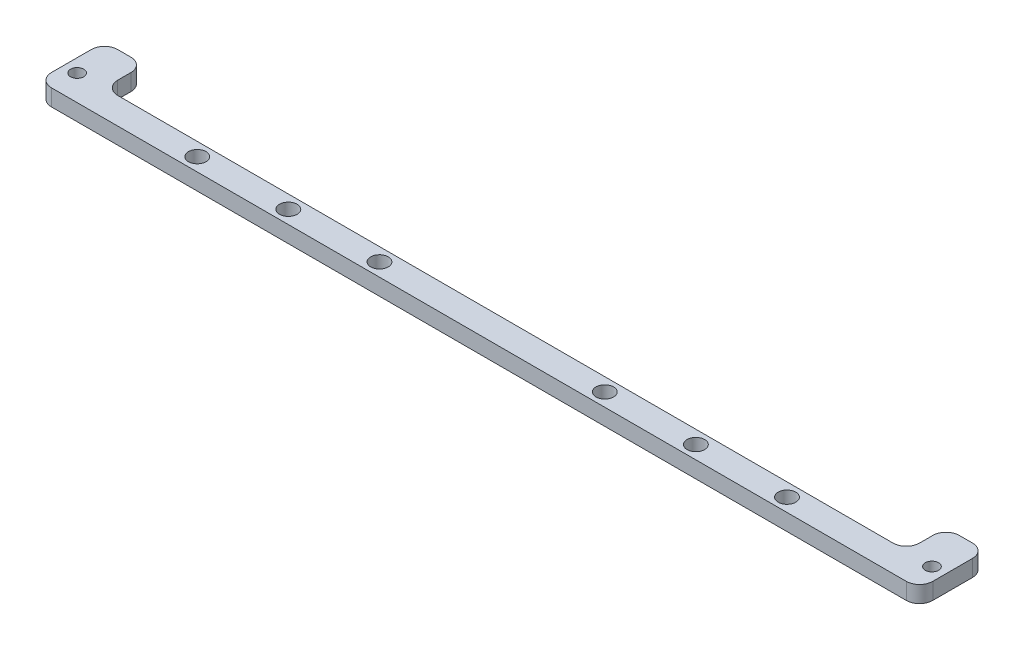
ISO-10303-21;
HEADER;
FILE_DESCRIPTION(('STEP AP214'),'2;1');
FILE_NAME('part.step','',(''),(''),'','','');
FILE_SCHEMA(('AUTOMOTIVE_DESIGN { 1 0 10303 214 1 1 1 1 }'));
ENDSEC;
DATA;
#1=APPLICATION_CONTEXT('core data for automotive mechanical design processes');
#2=APPLICATION_PROTOCOL_DEFINITION('international standard','automotive_design',2000,#1);
#3=PRODUCT_CONTEXT('',#1,'mechanical');
#4=PRODUCT('Part','Part','',(#3));
#5=PRODUCT_RELATED_PRODUCT_CATEGORY('part','',(#4));
#6=PRODUCT_DEFINITION_FORMATION('','',#4);
#7=PRODUCT_DEFINITION_CONTEXT('part definition',#1,'design');
#8=PRODUCT_DEFINITION('design','',#6,#7);
#9=PRODUCT_DEFINITION_SHAPE('','',#8);
#10=(LENGTH_UNIT() NAMED_UNIT(*) SI_UNIT(.MILLI.,.METRE.));
#11=(NAMED_UNIT(*) PLANE_ANGLE_UNIT() SI_UNIT($,.RADIAN.));
#12=(NAMED_UNIT(*) SI_UNIT($,.STERADIAN.) SOLID_ANGLE_UNIT());
#13=UNCERTAINTY_MEASURE_WITH_UNIT(LENGTH_MEASURE(1.E-05),#10,'distance_accuracy_value','');
#14=(GEOMETRIC_REPRESENTATION_CONTEXT(3) GLOBAL_UNCERTAINTY_ASSIGNED_CONTEXT((#13)) GLOBAL_UNIT_ASSIGNED_CONTEXT((#10,
#11,#12)) REPRESENTATION_CONTEXT('',''));
#15=CARTESIAN_POINT('',(0.,0.,0.));
#16=DIRECTION('',(0.,0.,1.));
#17=DIRECTION('',(1.,0.,0.));
#18=AXIS2_PLACEMENT_3D('',#15,#16,#17);
#19=CARTESIAN_POINT('',(-133.,5.,0.));
#20=DIRECTION('',(-1.,0.,0.));
#21=DIRECTION('',(0.,0.,1.));
#22=AXIS2_PLACEMENT_3D('',#19,#20,#21);
#23=PLANE('',#22);
#24=DIRECTION('',(0.,0.,-1.));
#25=VECTOR('',#24,1.);
#26=CARTESIAN_POINT('',(-133.,5.,0.));
#27=LINE('',#26,#25);
#28=CARTESIAN_POINT('',(-133.,5.,0.));
#29=VERTEX_POINT('',#28);
#30=CARTESIAN_POINT('',(-133.,5.,-12.));
#31=VERTEX_POINT('',#30);
#32=EDGE_CURVE('E335',#29,#31,#27,.T.);
#33=ORIENTED_EDGE('',*,*,#32,.T.);
#34=DIRECTION('',(0.,-1.,0.));
#35=VECTOR('',#34,1.);
#36=CARTESIAN_POINT('',(-133.,5.,-12.));
#37=LINE('',#36,#35);
#38=CARTESIAN_POINT('',(-133.,0.,-12.));
#39=VERTEX_POINT('',#38);
#40=EDGE_CURVE('E172',#31,#39,#37,.T.);
#41=ORIENTED_EDGE('',*,*,#40,.T.);
#42=DIRECTION('',(0.,0.,-1.));
#43=VECTOR('',#42,1.);
#44=CARTESIAN_POINT('',(-133.,0.,0.));
#45=LINE('',#44,#43);
#46=CARTESIAN_POINT('',(-133.,0.,0.));
#47=VERTEX_POINT('',#46);
#48=EDGE_CURVE('E156',#47,#39,#45,.T.);
#49=ORIENTED_EDGE('',*,*,#48,.F.);
#50=DIRECTION('',(0.,-1.,0.));
#51=VECTOR('',#50,1.);
#52=CARTESIAN_POINT('',(-133.,5.,0.));
#53=LINE('',#52,#51);
#54=EDGE_CURVE('E169',#47,#29,#53,.F.);
#55=ORIENTED_EDGE('',*,*,#54,.T.);
#56=EDGE_LOOP('',(#33,#41,#49,#55));
#57=FACE_BOUND('',#56,.T.);
#58=ADVANCED_FACE('F38',(#57),#23,.T.);
#59=CARTESIAN_POINT('',(0.,5.,4.));
#60=DIRECTION('',(0.,0.,-1.));
#61=DIRECTION('',(-1.,0.,0.));
#62=AXIS2_PLACEMENT_3D('',#59,#60,#61);
#63=PLANE('',#62);
#64=DIRECTION('',(1.,0.,0.));
#65=VECTOR('',#64,1.);
#66=CARTESIAN_POINT('',(0.,5.,4.));
#67=LINE('',#66,#65);
#68=CARTESIAN_POINT('',(-129.,5.,4.));
#69=VERTEX_POINT('',#68);
#70=CARTESIAN_POINT('',(129.,5.,4.));
#71=VERTEX_POINT('',#70);
#72=EDGE_CURVE('E339',#69,#71,#67,.T.);
#73=ORIENTED_EDGE('',*,*,#72,.F.);
#74=DIRECTION('',(0.,-1.,0.));
#75=VECTOR('',#74,1.);
#76=CARTESIAN_POINT('',(-129.,0.,4.));
#77=LINE('',#76,#75);
#78=CARTESIAN_POINT('',(-129.,0.,4.));
#79=VERTEX_POINT('',#78);
#80=EDGE_CURVE('E238',#69,#79,#77,.T.);
#81=ORIENTED_EDGE('',*,*,#80,.T.);
#82=DIRECTION('',(1.,0.,0.));
#83=VECTOR('',#82,1.);
#84=CARTESIAN_POINT('',(0.,0.,4.));
#85=LINE('',#84,#83);
#86=CARTESIAN_POINT('',(129.,0.,4.));
#87=VERTEX_POINT('',#86);
#88=EDGE_CURVE('E158',#79,#87,#85,.T.);
#89=ORIENTED_EDGE('',*,*,#88,.T.);
#90=DIRECTION('',(0.,-1.,0.));
#91=VECTOR('',#90,1.);
#92=CARTESIAN_POINT('',(129.,5.,4.));
#93=LINE('',#92,#91);
#94=EDGE_CURVE('E236',#87,#71,#93,.F.);
#95=ORIENTED_EDGE('',*,*,#94,.T.);
#96=EDGE_LOOP('',(#73,#81,#89,#95));
#97=FACE_BOUND('',#96,.T.);
#98=ADVANCED_FACE('F368',(#97),#63,.F.);
#99=CARTESIAN_POINT('',(133.,5.,0.));
#100=DIRECTION('',(-1.,0.,0.));
#101=DIRECTION('',(0.,0.,1.));
#102=AXIS2_PLACEMENT_3D('',#99,#100,#101);
#103=PLANE('',#102);
#104=DIRECTION('',(0.,0.,-1.));
#105=VECTOR('',#104,1.);
#106=CARTESIAN_POINT('',(133.,0.,0.));
#107=LINE('',#106,#105);
#108=CARTESIAN_POINT('',(133.,0.,0.));
#109=VERTEX_POINT('',#108);
#110=CARTESIAN_POINT('',(133.,0.,-12.));
#111=VERTEX_POINT('',#110);
#112=EDGE_CURVE('E299',#109,#111,#107,.T.);
#113=ORIENTED_EDGE('',*,*,#112,.T.);
#114=DIRECTION('',(0.,-1.,0.));
#115=VECTOR('',#114,1.);
#116=CARTESIAN_POINT('',(133.,5.,-12.));
#117=LINE('',#116,#115);
#118=CARTESIAN_POINT('',(133.,5.,-12.));
#119=VERTEX_POINT('',#118);
#120=EDGE_CURVE('E234',#111,#119,#117,.F.);
#121=ORIENTED_EDGE('',*,*,#120,.T.);
#122=DIRECTION('',(0.,0.,-1.));
#123=VECTOR('',#122,1.);
#124=CARTESIAN_POINT('',(133.,5.,0.));
#125=LINE('',#124,#123);
#126=CARTESIAN_POINT('',(133.,5.,0.));
#127=VERTEX_POINT('',#126);
#128=EDGE_CURVE('E342',#127,#119,#125,.T.);
#129=ORIENTED_EDGE('',*,*,#128,.F.);
#130=DIRECTION('',(0.,-1.,0.));
#131=VECTOR('',#130,1.);
#132=CARTESIAN_POINT('',(133.,5.,0.));
#133=LINE('',#132,#131);
#134=EDGE_CURVE('E231',#127,#109,#133,.T.);
#135=ORIENTED_EDGE('',*,*,#134,.T.);
#136=EDGE_LOOP('',(#113,#121,#129,#135));
#137=FACE_BOUND('',#136,.T.);
#138=ADVANCED_FACE('F360',(#137),#103,.F.);
#139=CARTESIAN_POINT('',(0.,5.,-16.));
#140=DIRECTION('',(0.,0.,1.));
#141=DIRECTION('',(1.,0.,0.));
#142=AXIS2_PLACEMENT_3D('',#139,#140,#141);
#143=PLANE('',#142);
#144=DIRECTION('',(-1.,0.,0.));
#145=VECTOR('',#144,1.);
#146=CARTESIAN_POINT('',(0.,0.,-16.));
#147=LINE('',#146,#145);
#148=CARTESIAN_POINT('',(129.,0.,-16.));
#149=VERTEX_POINT('',#148);
#150=CARTESIAN_POINT('',(125.,0.,-16.));
#151=VERTEX_POINT('',#150);
#152=EDGE_CURVE('E256',#149,#151,#147,.T.);
#153=ORIENTED_EDGE('',*,*,#152,.T.);
#154=DIRECTION('',(0.,-1.,0.));
#155=VECTOR('',#154,1.);
#156=CARTESIAN_POINT('',(125.,5.,-16.));
#157=LINE('',#156,#155);
#158=CARTESIAN_POINT('',(125.,5.,-16.));
#159=VERTEX_POINT('',#158);
#160=EDGE_CURVE('E229',#151,#159,#157,.F.);
#161=ORIENTED_EDGE('',*,*,#160,.T.);
#162=DIRECTION('',(-1.,0.,0.));
#163=VECTOR('',#162,1.);
#164=CARTESIAN_POINT('',(0.,5.,-16.));
#165=LINE('',#164,#163);
#166=CARTESIAN_POINT('',(129.,5.,-16.));
#167=VERTEX_POINT('',#166);
#168=EDGE_CURVE('E273',#167,#159,#165,.T.);
#169=ORIENTED_EDGE('',*,*,#168,.F.);
#170=DIRECTION('',(0.,-1.,0.));
#171=VECTOR('',#170,1.);
#172=CARTESIAN_POINT('',(129.,5.,-16.));
#173=LINE('',#172,#171);
#174=EDGE_CURVE('E226',#167,#149,#173,.T.);
#175=ORIENTED_EDGE('',*,*,#174,.T.);
#176=EDGE_LOOP('',(#153,#161,#169,#175));
#177=FACE_BOUND('',#176,.T.);
#178=ADVANCED_FACE('F354',(#177),#143,.F.);
#179=CARTESIAN_POINT('',(121.,5.,0.));
#180=DIRECTION('',(-1.,0.,0.));
#181=DIRECTION('',(0.,0.,1.));
#182=AXIS2_PLACEMENT_3D('',#179,#180,#181);
#183=PLANE('',#182);
#184=DIRECTION('',(0.,0.,-1.));
#185=VECTOR('',#184,1.);
#186=CARTESIAN_POINT('',(121.,0.,0.));
#187=LINE('',#186,#185);
#188=CARTESIAN_POINT('',(121.,0.,-8.));
#189=VERTEX_POINT('',#188);
#190=CARTESIAN_POINT('',(121.,0.,-12.));
#191=VERTEX_POINT('',#190);
#192=EDGE_CURVE('E245',#189,#191,#187,.T.);
#193=ORIENTED_EDGE('',*,*,#192,.F.);
#194=DIRECTION('',(0.,-1.,0.));
#195=VECTOR('',#194,1.);
#196=CARTESIAN_POINT('',(121.,5.,-8.));
#197=LINE('',#196,#195);
#198=CARTESIAN_POINT('',(121.,5.,-8.));
#199=VERTEX_POINT('',#198);
#200=EDGE_CURVE('E224',#189,#199,#197,.F.);
#201=ORIENTED_EDGE('',*,*,#200,.T.);
#202=DIRECTION('',(0.,0.,-1.));
#203=VECTOR('',#202,1.);
#204=CARTESIAN_POINT('',(121.,5.,0.));
#205=LINE('',#204,#203);
#206=CARTESIAN_POINT('',(121.,5.,-12.));
#207=VERTEX_POINT('',#206);
#208=EDGE_CURVE('E265',#199,#207,#205,.T.);
#209=ORIENTED_EDGE('',*,*,#208,.T.);
#210=DIRECTION('',(0.,-1.,0.));
#211=VECTOR('',#210,1.);
#212=CARTESIAN_POINT('',(121.,0.,-12.));
#213=LINE('',#212,#211);
#214=EDGE_CURVE('E221',#207,#191,#213,.T.);
#215=ORIENTED_EDGE('',*,*,#214,.T.);
#216=EDGE_LOOP('',(#193,#201,#209,#215));
#217=FACE_BOUND('',#216,.T.);
#218=ADVANCED_FACE('F252',(#217),#183,.T.);
#219=CARTESIAN_POINT('',(0.,5.,-4.));
#220=DIRECTION('',(0.,0.,-1.));
#221=DIRECTION('',(-1.,0.,0.));
#222=AXIS2_PLACEMENT_3D('',#219,#220,#221);
#223=PLANE('',#222);
#224=DIRECTION('',(1.,0.,0.));
#225=VECTOR('',#224,1.);
#226=CARTESIAN_POINT('',(0.,0.,-4.));
#227=LINE('',#226,#225);
#228=CARTESIAN_POINT('',(-117.,0.,-4.));
#229=VERTEX_POINT('',#228);
#230=CARTESIAN_POINT('',(117.,0.,-4.));
#231=VERTEX_POINT('',#230);
#232=EDGE_CURVE('E247',#229,#231,#227,.T.);
#233=ORIENTED_EDGE('',*,*,#232,.F.);
#234=DIRECTION('',(0.,-1.,0.));
#235=VECTOR('',#234,1.);
#236=CARTESIAN_POINT('',(-117.,5.,-4.));
#237=LINE('',#236,#235);
#238=CARTESIAN_POINT('',(-117.,5.,-4.));
#239=VERTEX_POINT('',#238);
#240=EDGE_CURVE('E219',#229,#239,#237,.F.);
#241=ORIENTED_EDGE('',*,*,#240,.T.);
#242=DIRECTION('',(1.,0.,0.));
#243=VECTOR('',#242,1.);
#244=CARTESIAN_POINT('',(0.,5.,-4.));
#245=LINE('',#244,#243);
#246=CARTESIAN_POINT('',(117.,5.,-4.));
#247=VERTEX_POINT('',#246);
#248=EDGE_CURVE('E264',#239,#247,#245,.T.);
#249=ORIENTED_EDGE('',*,*,#248,.T.);
#250=DIRECTION('',(0.,-1.,0.));
#251=VECTOR('',#250,1.);
#252=CARTESIAN_POINT('',(117.,0.,-4.));
#253=LINE('',#252,#251);
#254=EDGE_CURVE('E216',#247,#231,#253,.T.);
#255=ORIENTED_EDGE('',*,*,#254,.T.);
#256=EDGE_LOOP('',(#233,#241,#249,#255));
#257=FACE_BOUND('',#256,.T.);
#258=ADVANCED_FACE('F267',(#257),#223,.T.);
#259=CARTESIAN_POINT('',(-121.,5.,0.));
#260=DIRECTION('',(-1.,0.,0.));
#261=DIRECTION('',(0.,0.,1.));
#262=AXIS2_PLACEMENT_3D('',#259,#260,#261);
#263=PLANE('',#262);
#264=DIRECTION('',(0.,0.,-1.));
#265=VECTOR('',#264,1.);
#266=CARTESIAN_POINT('',(-121.,0.,0.));
#267=LINE('',#266,#265);
#268=CARTESIAN_POINT('',(-121.,0.,-8.));
#269=VERTEX_POINT('',#268);
#270=CARTESIAN_POINT('',(-121.,0.,-12.));
#271=VERTEX_POINT('',#270);
#272=EDGE_CURVE('E305',#269,#271,#267,.T.);
#273=ORIENTED_EDGE('',*,*,#272,.T.);
#274=DIRECTION('',(0.,-1.,0.));
#275=VECTOR('',#274,1.);
#276=CARTESIAN_POINT('',(-121.,5.,-12.));
#277=LINE('',#276,#275);
#278=CARTESIAN_POINT('',(-121.,5.,-12.));
#279=VERTEX_POINT('',#278);
#280=EDGE_CURVE('E53',#271,#279,#277,.F.);
#281=ORIENTED_EDGE('',*,*,#280,.T.);
#282=DIRECTION('',(0.,0.,-1.));
#283=VECTOR('',#282,1.);
#284=CARTESIAN_POINT('',(-121.,5.,0.));
#285=LINE('',#284,#283);
#286=CARTESIAN_POINT('',(-121.,5.,-8.));
#287=VERTEX_POINT('',#286);
#288=EDGE_CURVE('E269',#287,#279,#285,.T.);
#289=ORIENTED_EDGE('',*,*,#288,.F.);
#290=DIRECTION('',(0.,-1.,0.));
#291=VECTOR('',#290,1.);
#292=CARTESIAN_POINT('',(-121.,5.,-8.));
#293=LINE('',#292,#291);
#294=EDGE_CURVE('E212',#287,#269,#293,.T.);
#295=ORIENTED_EDGE('',*,*,#294,.T.);
#296=EDGE_LOOP('',(#273,#281,#289,#295));
#297=FACE_BOUND('',#296,.T.);
#298=ADVANCED_FACE('F381',(#297),#263,.F.);
#299=CARTESIAN_POINT('',(-61.5,5.,0.));
#300=DIRECTION('',(0.,-1.,0.));
#301=DIRECTION('',(0.,0.,-1.));
#302=AXIS2_PLACEMENT_3D('',#299,#300,#301);
#303=CYLINDRICAL_SURFACE('',#302,2.65);
#304=CARTESIAN_POINT('',(-61.5,5.,0.));
#305=DIRECTION('',(0.,1.,0.));
#306=DIRECTION('',(0.,0.,1.));
#307=AXIS2_PLACEMENT_3D('',#304,#305,#306);
#308=CIRCLE('',#307,2.65);
#309=CARTESIAN_POINT('',(-61.5,5.,2.65));
#310=VERTEX_POINT('',#309);
#311=EDGE_CURVE('E182',#310,#310,#308,.T.);
#312=ORIENTED_EDGE('',*,*,#311,.T.);
#313=EDGE_LOOP('',(#312));
#314=FACE_BOUND('',#313,.T.);
#315=CARTESIAN_POINT('',(-61.5,0.,0.));
#316=DIRECTION('',(0.,1.,0.));
#317=DIRECTION('',(0.,0.,1.));
#318=AXIS2_PLACEMENT_3D('',#315,#316,#317);
#319=CIRCLE('',#318,2.65);
#320=CARTESIAN_POINT('',(-61.5,0.,2.65));
#321=VERTEX_POINT('',#320);
#322=EDGE_CURVE('E321',#321,#321,#319,.T.);
#323=ORIENTED_EDGE('',*,*,#322,.F.);
#324=EDGE_LOOP('',(#323));
#325=FACE_BOUND('',#324,.T.);
#326=ADVANCED_FACE('F425',(#314,#325),#303,.F.);
#327=CARTESIAN_POINT('',(-34.,5.,0.));
#328=DIRECTION('',(0.,-1.,0.));
#329=DIRECTION('',(0.,0.,-1.));
#330=AXIS2_PLACEMENT_3D('',#327,#328,#329);
#331=CYLINDRICAL_SURFACE('',#330,2.65);
#332=CARTESIAN_POINT('',(-34.,5.,0.));
#333=DIRECTION('',(0.,1.,0.));
#334=DIRECTION('',(0.,0.,1.));
#335=AXIS2_PLACEMENT_3D('',#332,#333,#334);
#336=CIRCLE('',#335,2.65);
#337=CARTESIAN_POINT('',(-34.,5.,2.65));
#338=VERTEX_POINT('',#337);
#339=EDGE_CURVE('E288',#338,#338,#336,.T.);
#340=ORIENTED_EDGE('',*,*,#339,.T.);
#341=EDGE_LOOP('',(#340));
#342=FACE_BOUND('',#341,.T.);
#343=CARTESIAN_POINT('',(-34.,0.,0.));
#344=DIRECTION('',(0.,1.,0.));
#345=DIRECTION('',(0.,0.,1.));
#346=AXIS2_PLACEMENT_3D('',#343,#344,#345);
#347=CIRCLE('',#346,2.65);
#348=CARTESIAN_POINT('',(-34.,0.,2.65));
#349=VERTEX_POINT('',#348);
#350=EDGE_CURVE('E319',#349,#349,#347,.T.);
#351=ORIENTED_EDGE('',*,*,#350,.F.);
#352=EDGE_LOOP('',(#351));
#353=FACE_BOUND('',#352,.T.);
#354=ADVANCED_FACE('F428',(#342,#353),#331,.F.);
#355=CARTESIAN_POINT('',(34.,5.,0.));
#356=DIRECTION('',(0.,-1.,0.));
#357=DIRECTION('',(0.,0.,-1.));
#358=AXIS2_PLACEMENT_3D('',#355,#356,#357);
#359=CYLINDRICAL_SURFACE('',#358,2.65);
#360=CARTESIAN_POINT('',(34.,5.,0.));
#361=DIRECTION('',(0.,1.,0.));
#362=DIRECTION('',(0.,0.,1.));
#363=AXIS2_PLACEMENT_3D('',#360,#361,#362);
#364=CIRCLE('',#363,2.65);
#365=CARTESIAN_POINT('',(34.,5.,2.64999999999999));
#366=VERTEX_POINT('',#365);
#367=EDGE_CURVE('E285',#366,#366,#364,.T.);
#368=ORIENTED_EDGE('',*,*,#367,.T.);
#369=EDGE_LOOP('',(#368));
#370=FACE_BOUND('',#369,.T.);
#371=CARTESIAN_POINT('',(34.,0.,0.));
#372=DIRECTION('',(0.,1.,0.));
#373=DIRECTION('',(0.,0.,1.));
#374=AXIS2_PLACEMENT_3D('',#371,#372,#373);
#375=CIRCLE('',#374,2.65);
#376=CARTESIAN_POINT('',(34.,0.,2.64999999999999));
#377=VERTEX_POINT('',#376);
#378=EDGE_CURVE('E316',#377,#377,#375,.T.);
#379=ORIENTED_EDGE('',*,*,#378,.F.);
#380=EDGE_LOOP('',(#379));
#381=FACE_BOUND('',#380,.T.);
#382=ADVANCED_FACE('F432',(#370,#381),#359,.F.);
#383=CARTESIAN_POINT('',(89.,5.,0.));
#384=DIRECTION('',(0.,-1.,0.));
#385=DIRECTION('',(0.,0.,-1.));
#386=AXIS2_PLACEMENT_3D('',#383,#384,#385);
#387=CYLINDRICAL_SURFACE('',#386,2.65);
#388=CARTESIAN_POINT('',(89.,5.,0.));
#389=DIRECTION('',(0.,1.,0.));
#390=DIRECTION('',(0.,0.,1.));
#391=AXIS2_PLACEMENT_3D('',#388,#389,#390);
#392=CIRCLE('',#391,2.65);
#393=CARTESIAN_POINT('',(89.,5.,2.64999999999997));
#394=VERTEX_POINT('',#393);
#395=EDGE_CURVE('E282',#394,#394,#392,.T.);
#396=ORIENTED_EDGE('',*,*,#395,.T.);
#397=EDGE_LOOP('',(#396));
#398=FACE_BOUND('',#397,.T.);
#399=CARTESIAN_POINT('',(89.,0.,0.));
#400=DIRECTION('',(0.,1.,0.));
#401=DIRECTION('',(0.,0.,1.));
#402=AXIS2_PLACEMENT_3D('',#399,#400,#401);
#403=CIRCLE('',#402,2.65);
#404=CARTESIAN_POINT('',(89.,0.,2.64999999999997));
#405=VERTEX_POINT('',#404);
#406=EDGE_CURVE('E313',#405,#405,#403,.T.);
#407=ORIENTED_EDGE('',*,*,#406,.F.);
#408=EDGE_LOOP('',(#407));
#409=FACE_BOUND('',#408,.T.);
#410=ADVANCED_FACE('F436',(#398,#409),#387,.F.);
#411=CARTESIAN_POINT('',(61.5,5.,0.));
#412=DIRECTION('',(0.,-1.,0.));
#413=DIRECTION('',(0.,0.,-1.));
#414=AXIS2_PLACEMENT_3D('',#411,#412,#413);
#415=CYLINDRICAL_SURFACE('',#414,2.65);
#416=CARTESIAN_POINT('',(61.5,5.,0.));
#417=DIRECTION('',(0.,1.,0.));
#418=DIRECTION('',(0.,0.,1.));
#419=AXIS2_PLACEMENT_3D('',#416,#417,#418);
#420=CIRCLE('',#419,2.65);
#421=CARTESIAN_POINT('',(61.5,5.,2.64999999999998));
#422=VERTEX_POINT('',#421);
#423=EDGE_CURVE('E279',#422,#422,#420,.T.);
#424=ORIENTED_EDGE('',*,*,#423,.T.);
#425=EDGE_LOOP('',(#424));
#426=FACE_BOUND('',#425,.T.);
#427=CARTESIAN_POINT('',(61.5,0.,0.));
#428=DIRECTION('',(0.,1.,0.));
#429=DIRECTION('',(0.,0.,1.));
#430=AXIS2_PLACEMENT_3D('',#427,#428,#429);
#431=CIRCLE('',#430,2.65);
#432=CARTESIAN_POINT('',(61.5,0.,2.64999999999998));
#433=VERTEX_POINT('',#432);
#434=EDGE_CURVE('E310',#433,#433,#431,.T.);
#435=ORIENTED_EDGE('',*,*,#434,.F.);
#436=EDGE_LOOP('',(#435));
#437=FACE_BOUND('',#436,.T.);
#438=ADVANCED_FACE('F440',(#426,#437),#415,.F.);
#439=CARTESIAN_POINT('',(0.,5.,-16.));
#440=DIRECTION('',(0.,0.,-1.));
#441=DIRECTION('',(-1.,0.,0.));
#442=AXIS2_PLACEMENT_3D('',#439,#440,#441);
#443=PLANE('',#442);
#444=DIRECTION('',(1.,0.,0.));
#445=VECTOR('',#444,1.);
#446=CARTESIAN_POINT('',(0.,0.,-16.));
#447=LINE('',#446,#445);
#448=CARTESIAN_POINT('',(-129.,0.,-16.));
#449=VERTEX_POINT('',#448);
#450=CARTESIAN_POINT('',(-125.,0.,-16.));
#451=VERTEX_POINT('',#450);
#452=EDGE_CURVE('E307',#449,#451,#447,.T.);
#453=ORIENTED_EDGE('',*,*,#452,.F.);
#454=DIRECTION('',(0.,-1.,0.));
#455=VECTOR('',#454,1.);
#456=CARTESIAN_POINT('',(-129.,5.,-16.));
#457=LINE('',#456,#455);
#458=CARTESIAN_POINT('',(-129.,5.,-16.));
#459=VERTEX_POINT('',#458);
#460=EDGE_CURVE('E199',#449,#459,#457,.F.);
#461=ORIENTED_EDGE('',*,*,#460,.T.);
#462=DIRECTION('',(1.,0.,0.));
#463=VECTOR('',#462,1.);
#464=CARTESIAN_POINT('',(0.,5.,-16.));
#465=LINE('',#464,#463);
#466=CARTESIAN_POINT('',(-125.,5.,-16.));
#467=VERTEX_POINT('',#466);
#468=EDGE_CURVE('E271',#459,#467,#465,.T.);
#469=ORIENTED_EDGE('',*,*,#468,.T.);
#470=DIRECTION('',(0.,-1.,0.));
#471=VECTOR('',#470,1.);
#472=CARTESIAN_POINT('',(-125.,0.,-16.));
#473=LINE('',#472,#471);
#474=EDGE_CURVE('E196',#467,#451,#473,.T.);
#475=ORIENTED_EDGE('',*,*,#474,.T.);
#476=EDGE_LOOP('',(#453,#461,#469,#475));
#477=FACE_BOUND('',#476,.T.);
#478=ADVANCED_FACE('F375',(#477),#443,.T.);
#479=CARTESIAN_POINT('',(-129.,5.,-3.75));
#480=DIRECTION('',(0.,-1.,0.));
#481=DIRECTION('',(0.,0.,-1.));
#482=AXIS2_PLACEMENT_3D('',#479,#480,#481);
#483=CYLINDRICAL_SURFACE('',#482,2.);
#484=CARTESIAN_POINT('',(-129.,5.,-3.75));
#485=DIRECTION('',(0.,1.,0.));
#486=DIRECTION('',(0.,0.,1.));
#487=AXIS2_PLACEMENT_3D('',#484,#485,#486);
#488=CIRCLE('',#487,2.);
#489=CARTESIAN_POINT('',(-129.,5.,-1.75));
#490=VERTEX_POINT('',#489);
#491=EDGE_CURVE('E330',#490,#490,#488,.F.);
#492=ORIENTED_EDGE('',*,*,#491,.F.);
#493=EDGE_LOOP('',(#492));
#494=FACE_BOUND('',#493,.T.);
#495=CARTESIAN_POINT('',(-129.,0.,-3.75));
#496=DIRECTION('',(0.,1.,0.));
#497=DIRECTION('',(0.,0.,1.));
#498=AXIS2_PLACEMENT_3D('',#495,#496,#497);
#499=CIRCLE('',#498,2.);
#500=CARTESIAN_POINT('',(-129.,0.,-1.75));
#501=VERTEX_POINT('',#500);
#502=EDGE_CURVE('E173',#501,#501,#499,.F.);
#503=ORIENTED_EDGE('',*,*,#502,.T.);
#504=EDGE_LOOP('',(#503));
#505=FACE_BOUND('',#504,.T.);
#506=ADVANCED_FACE('F401',(#494,#505),#483,.F.);
#507=CARTESIAN_POINT('',(129.,5.,-3.75));
#508=DIRECTION('',(0.,-1.,0.));
#509=DIRECTION('',(0.,0.,-1.));
#510=AXIS2_PLACEMENT_3D('',#507,#508,#509);
#511=CYLINDRICAL_SURFACE('',#510,2.);
#512=CARTESIAN_POINT('',(129.,5.,-3.75));
#513=DIRECTION('',(0.,1.,0.));
#514=DIRECTION('',(0.,0.,1.));
#515=AXIS2_PLACEMENT_3D('',#512,#513,#514);
#516=CIRCLE('',#515,2.);
#517=CARTESIAN_POINT('',(129.,5.,-1.75));
#518=VERTEX_POINT('',#517);
#519=EDGE_CURVE('E326',#518,#518,#516,.T.);
#520=ORIENTED_EDGE('',*,*,#519,.T.);
#521=EDGE_LOOP('',(#520));
#522=FACE_BOUND('',#521,.T.);
#523=CARTESIAN_POINT('',(129.,0.,-3.75));
#524=DIRECTION('',(0.,1.,0.));
#525=DIRECTION('',(0.,0.,1.));
#526=AXIS2_PLACEMENT_3D('',#523,#524,#525);
#527=CIRCLE('',#526,2.);
#528=CARTESIAN_POINT('',(129.,0.,-1.75));
#529=VERTEX_POINT('',#528);
#530=EDGE_CURVE('E293',#529,#529,#527,.T.);
#531=ORIENTED_EDGE('',*,*,#530,.F.);
#532=EDGE_LOOP('',(#531));
#533=FACE_BOUND('',#532,.T.);
#534=ADVANCED_FACE('F404',(#522,#533),#511,.F.);
#535=CARTESIAN_POINT('',(-89.,5.,0.));
#536=DIRECTION('',(0.,-1.,0.));
#537=DIRECTION('',(0.,0.,-1.));
#538=AXIS2_PLACEMENT_3D('',#535,#536,#537);
#539=CYLINDRICAL_SURFACE('',#538,2.65);
#540=CARTESIAN_POINT('',(-89.,5.,0.));
#541=DIRECTION('',(0.,1.,0.));
#542=DIRECTION('',(0.,0.,1.));
#543=AXIS2_PLACEMENT_3D('',#540,#541,#542);
#544=CIRCLE('',#543,2.65);
#545=CARTESIAN_POINT('',(-89.,5.,2.65));
#546=VERTEX_POINT('',#545);
#547=EDGE_CURVE('E178',#546,#546,#544,.T.);
#548=ORIENTED_EDGE('',*,*,#547,.T.);
#549=EDGE_LOOP('',(#548));
#550=FACE_BOUND('',#549,.T.);
#551=CARTESIAN_POINT('',(-89.,0.,0.));
#552=DIRECTION('',(0.,1.,0.));
#553=DIRECTION('',(0.,0.,1.));
#554=AXIS2_PLACEMENT_3D('',#551,#552,#553);
#555=CIRCLE('',#554,2.65);
#556=CARTESIAN_POINT('',(-89.,0.,2.65));
#557=VERTEX_POINT('',#556);
#558=EDGE_CURVE('E185',#557,#557,#555,.T.);
#559=ORIENTED_EDGE('',*,*,#558,.F.);
#560=EDGE_LOOP('',(#559));
#561=FACE_BOUND('',#560,.T.);
#562=ADVANCED_FACE('F408',(#550,#561),#539,.F.);
#563=CARTESIAN_POINT('',(0.,5.,0.));
#564=DIRECTION('',(0.,1.,0.));
#565=DIRECTION('',(0.,0.,1.));
#566=AXIS2_PLACEMENT_3D('',#563,#564,#565);
#567=PLANE('',#566);
#568=ORIENTED_EDGE('',*,*,#519,.F.);
#569=EDGE_LOOP('',(#568));
#570=FACE_BOUND('',#569,.T.);
#571=ORIENTED_EDGE('',*,*,#491,.T.);
#572=EDGE_LOOP('',(#571));
#573=FACE_BOUND('',#572,.T.);
#574=ORIENTED_EDGE('',*,*,#468,.F.);
#575=CARTESIAN_POINT('',(-129.,5.,-12.));
#576=DIRECTION('',(0.,1.,0.));
#577=DIRECTION('',(0.,0.,1.));
#578=AXIS2_PLACEMENT_3D('',#575,#576,#577);
#579=CIRCLE('',#578,4.);
#580=EDGE_CURVE('E210',#459,#31,#579,.T.);
#581=ORIENTED_EDGE('',*,*,#580,.T.);
#582=ORIENTED_EDGE('',*,*,#32,.F.);
#583=CARTESIAN_POINT('',(-129.,5.,0.));
#584=DIRECTION('',(0.,1.,0.));
#585=DIRECTION('',(0.,0.,1.));
#586=AXIS2_PLACEMENT_3D('',#583,#584,#585);
#587=CIRCLE('',#586,4.);
#588=EDGE_CURVE('E177',#29,#69,#587,.T.);
#589=ORIENTED_EDGE('',*,*,#588,.T.);
#590=ORIENTED_EDGE('',*,*,#72,.T.);
#591=CARTESIAN_POINT('',(129.,5.,0.));
#592=DIRECTION('',(0.,1.,0.));
#593=DIRECTION('',(0.,0.,1.));
#594=AXIS2_PLACEMENT_3D('',#591,#592,#593);
#595=CIRCLE('',#594,4.);
#596=EDGE_CURVE('E201',#71,#127,#595,.T.);
#597=ORIENTED_EDGE('',*,*,#596,.T.);
#598=ORIENTED_EDGE('',*,*,#128,.T.);
#599=CARTESIAN_POINT('',(129.,5.,-12.));
#600=DIRECTION('',(0.,1.,0.));
#601=DIRECTION('',(0.,0.,1.));
#602=AXIS2_PLACEMENT_3D('',#599,#600,#601);
#603=CIRCLE('',#602,4.);
#604=EDGE_CURVE('E204',#119,#167,#603,.T.);
#605=ORIENTED_EDGE('',*,*,#604,.T.);
#606=ORIENTED_EDGE('',*,*,#168,.T.);
#607=CARTESIAN_POINT('',(125.,5.,-12.));
#608=DIRECTION('',(0.,1.,0.));
#609=DIRECTION('',(0.,0.,1.));
#610=AXIS2_PLACEMENT_3D('',#607,#608,#609);
#611=CIRCLE('',#610,4.);
#612=EDGE_CURVE('E206',#159,#207,#611,.T.);
#613=ORIENTED_EDGE('',*,*,#612,.T.);
#614=ORIENTED_EDGE('',*,*,#208,.F.);
#615=CARTESIAN_POINT('',(117.,5.,-8.));
#616=DIRECTION('',(0.,1.,0.));
#617=DIRECTION('',(0.,0.,1.));
#618=AXIS2_PLACEMENT_3D('',#615,#616,#617);
#619=CIRCLE('',#618,4.);
#620=EDGE_CURVE('E11',#199,#247,#619,.F.);
#621=ORIENTED_EDGE('',*,*,#620,.T.);
#622=ORIENTED_EDGE('',*,*,#248,.F.);
#623=CARTESIAN_POINT('',(-117.,5.,-8.));
#624=DIRECTION('',(0.,1.,0.));
#625=DIRECTION('',(0.,0.,1.));
#626=AXIS2_PLACEMENT_3D('',#623,#624,#625);
#627=CIRCLE('',#626,4.);
#628=EDGE_CURVE('E60',#239,#287,#627,.F.);
#629=ORIENTED_EDGE('',*,*,#628,.T.);
#630=ORIENTED_EDGE('',*,*,#288,.T.);
#631=CARTESIAN_POINT('',(-125.,5.,-12.));
#632=DIRECTION('',(0.,1.,0.));
#633=DIRECTION('',(0.,0.,1.));
#634=AXIS2_PLACEMENT_3D('',#631,#632,#633);
#635=CIRCLE('',#634,4.);
#636=EDGE_CURVE('E208',#279,#467,#635,.T.);
#637=ORIENTED_EDGE('',*,*,#636,.T.);
#638=EDGE_LOOP('',(#574,#581,#582,#589,#590,#597,#598,#605,#606,#613,#614,#621,#622,#629,#630,#637));
#639=FACE_BOUND('',#638,.T.);
#640=ORIENTED_EDGE('',*,*,#423,.F.);
#641=EDGE_LOOP('',(#640));
#642=FACE_BOUND('',#641,.T.);
#643=ORIENTED_EDGE('',*,*,#395,.F.);
#644=EDGE_LOOP('',(#643));
#645=FACE_BOUND('',#644,.T.);
#646=ORIENTED_EDGE('',*,*,#367,.F.);
#647=EDGE_LOOP('',(#646));
#648=FACE_BOUND('',#647,.T.);
#649=ORIENTED_EDGE('',*,*,#339,.F.);
#650=EDGE_LOOP('',(#649));
#651=FACE_BOUND('',#650,.T.);
#652=ORIENTED_EDGE('',*,*,#311,.F.);
#653=EDGE_LOOP('',(#652));
#654=FACE_BOUND('',#653,.T.);
#655=ORIENTED_EDGE('',*,*,#547,.F.);
#656=EDGE_LOOP('',(#655));
#657=FACE_BOUND('',#656,.T.);
#658=ADVANCED_FACE('F262',(#570,#573,#639,#642,#645,#648,#651,#654,#657),#567,.T.);
#659=CARTESIAN_POINT('',(0.,0.,0.));
#660=DIRECTION('',(0.,1.,0.));
#661=DIRECTION('',(0.,0.,1.));
#662=AXIS2_PLACEMENT_3D('',#659,#660,#661);
#663=PLANE('',#662);
#664=ORIENTED_EDGE('',*,*,#530,.T.);
#665=EDGE_LOOP('',(#664));
#666=FACE_BOUND('',#665,.T.);
#667=ORIENTED_EDGE('',*,*,#502,.F.);
#668=EDGE_LOOP('',(#667));
#669=FACE_BOUND('',#668,.T.);
#670=ORIENTED_EDGE('',*,*,#48,.T.);
#671=CARTESIAN_POINT('',(-129.,0.,-12.));
#672=DIRECTION('',(0.,1.,0.));
#673=DIRECTION('',(0.,0.,1.));
#674=AXIS2_PLACEMENT_3D('',#671,#672,#673);
#675=CIRCLE('',#674,4.);
#676=EDGE_CURVE('E194',#39,#449,#675,.F.);
#677=ORIENTED_EDGE('',*,*,#676,.T.);
#678=ORIENTED_EDGE('',*,*,#452,.T.);
#679=CARTESIAN_POINT('',(-125.,0.,-12.));
#680=DIRECTION('',(0.,1.,0.));
#681=DIRECTION('',(0.,0.,1.));
#682=AXIS2_PLACEMENT_3D('',#679,#680,#681);
#683=CIRCLE('',#682,4.);
#684=EDGE_CURVE('E192',#451,#271,#683,.F.);
#685=ORIENTED_EDGE('',*,*,#684,.T.);
#686=ORIENTED_EDGE('',*,*,#272,.F.);
#687=CARTESIAN_POINT('',(-117.,0.,-8.));
#688=DIRECTION('',(0.,1.,0.));
#689=DIRECTION('',(0.,0.,1.));
#690=AXIS2_PLACEMENT_3D('',#687,#688,#689);
#691=CIRCLE('',#690,4.);
#692=EDGE_CURVE('E240',#269,#229,#691,.T.);
#693=ORIENTED_EDGE('',*,*,#692,.T.);
#694=ORIENTED_EDGE('',*,*,#232,.T.);
#695=CARTESIAN_POINT('',(117.,0.,-8.));
#696=DIRECTION('',(0.,1.,0.));
#697=DIRECTION('',(0.,0.,1.));
#698=AXIS2_PLACEMENT_3D('',#695,#696,#697);
#699=CIRCLE('',#698,4.);
#700=EDGE_CURVE('E46',#231,#189,#699,.T.);
#701=ORIENTED_EDGE('',*,*,#700,.T.);
#702=ORIENTED_EDGE('',*,*,#192,.T.);
#703=CARTESIAN_POINT('',(125.,0.,-12.));
#704=DIRECTION('',(0.,1.,0.));
#705=DIRECTION('',(0.,0.,1.));
#706=AXIS2_PLACEMENT_3D('',#703,#704,#705);
#707=CIRCLE('',#706,4.);
#708=EDGE_CURVE('E190',#191,#151,#707,.F.);
#709=ORIENTED_EDGE('',*,*,#708,.T.);
#710=ORIENTED_EDGE('',*,*,#152,.F.);
#711=CARTESIAN_POINT('',(129.,0.,-12.));
#712=DIRECTION('',(0.,1.,0.));
#713=DIRECTION('',(0.,0.,1.));
#714=AXIS2_PLACEMENT_3D('',#711,#712,#713);
#715=CIRCLE('',#714,4.);
#716=EDGE_CURVE('E163',#149,#111,#715,.F.);
#717=ORIENTED_EDGE('',*,*,#716,.T.);
#718=ORIENTED_EDGE('',*,*,#112,.F.);
#719=CARTESIAN_POINT('',(129.,0.,0.));
#720=DIRECTION('',(0.,1.,0.));
#721=DIRECTION('',(0.,0.,1.));
#722=AXIS2_PLACEMENT_3D('',#719,#720,#721);
#723=CIRCLE('',#722,4.);
#724=EDGE_CURVE('E164',#109,#87,#723,.F.);
#725=ORIENTED_EDGE('',*,*,#724,.T.);
#726=ORIENTED_EDGE('',*,*,#88,.F.);
#727=CARTESIAN_POINT('',(-129.,0.,0.));
#728=DIRECTION('',(0.,1.,0.));
#729=DIRECTION('',(0.,0.,1.));
#730=AXIS2_PLACEMENT_3D('',#727,#728,#729);
#731=CIRCLE('',#730,4.);
#732=EDGE_CURVE('E152',#79,#47,#731,.F.);
#733=ORIENTED_EDGE('',*,*,#732,.T.);
#734=EDGE_LOOP('',(#670,#677,#678,#685,#686,#693,#694,#701,#702,#709,#710,#717,#718,#725,#726,#733));
#735=FACE_BOUND('',#734,.T.);
#736=ORIENTED_EDGE('',*,*,#434,.T.);
#737=EDGE_LOOP('',(#736));
#738=FACE_BOUND('',#737,.T.);
#739=ORIENTED_EDGE('',*,*,#406,.T.);
#740=EDGE_LOOP('',(#739));
#741=FACE_BOUND('',#740,.T.);
#742=ORIENTED_EDGE('',*,*,#378,.T.);
#743=EDGE_LOOP('',(#742));
#744=FACE_BOUND('',#743,.T.);
#745=ORIENTED_EDGE('',*,*,#350,.T.);
#746=EDGE_LOOP('',(#745));
#747=FACE_BOUND('',#746,.T.);
#748=ORIENTED_EDGE('',*,*,#322,.T.);
#749=EDGE_LOOP('',(#748));
#750=FACE_BOUND('',#749,.T.);
#751=ORIENTED_EDGE('',*,*,#558,.T.);
#752=EDGE_LOOP('',(#751));
#753=FACE_BOUND('',#752,.T.);
#754=ADVANCED_FACE('F154',(#666,#669,#735,#738,#741,#744,#747,#750,#753),#663,.F.);
#755=CARTESIAN_POINT('',(-129.,5.,-12.));
#756=DIRECTION('',(0.,-1.,0.));
#757=DIRECTION('',(0.,0.,-1.));
#758=AXIS2_PLACEMENT_3D('',#755,#756,#757);
#759=CYLINDRICAL_SURFACE('',#758,4.);
#760=ORIENTED_EDGE('',*,*,#580,.F.);
#761=ORIENTED_EDGE('',*,*,#460,.F.);
#762=ORIENTED_EDGE('',*,*,#676,.F.);
#763=ORIENTED_EDGE('',*,*,#40,.F.);
#764=EDGE_LOOP('',(#760,#761,#762,#763));
#765=FACE_BOUND('',#764,.T.);
#766=ADVANCED_FACE('F371',(#765),#759,.T.);
#767=CARTESIAN_POINT('',(-125.,5.,-12.));
#768=DIRECTION('',(0.,1.,0.));
#769=DIRECTION('',(0.,0.,1.));
#770=AXIS2_PLACEMENT_3D('',#767,#768,#769);
#771=CYLINDRICAL_SURFACE('',#770,4.);
#772=ORIENTED_EDGE('',*,*,#636,.F.);
#773=ORIENTED_EDGE('',*,*,#280,.F.);
#774=ORIENTED_EDGE('',*,*,#684,.F.);
#775=ORIENTED_EDGE('',*,*,#474,.F.);
#776=EDGE_LOOP('',(#772,#773,#774,#775));
#777=FACE_BOUND('',#776,.T.);
#778=ADVANCED_FACE('F379',(#777),#771,.T.);
#779=CARTESIAN_POINT('',(-117.,5.,-8.));
#780=DIRECTION('',(0.,-1.,0.));
#781=DIRECTION('',(0.,0.,-1.));
#782=AXIS2_PLACEMENT_3D('',#779,#780,#781);
#783=CYLINDRICAL_SURFACE('',#782,4.);
#784=ORIENTED_EDGE('',*,*,#628,.F.);
#785=ORIENTED_EDGE('',*,*,#240,.F.);
#786=ORIENTED_EDGE('',*,*,#692,.F.);
#787=ORIENTED_EDGE('',*,*,#294,.F.);
#788=EDGE_LOOP('',(#784,#785,#786,#787));
#789=FACE_BOUND('',#788,.T.);
#790=ADVANCED_FACE('F384',(#789),#783,.F.);
#791=CARTESIAN_POINT('',(117.,5.,-8.));
#792=DIRECTION('',(0.,1.,0.));
#793=DIRECTION('',(0.,0.,1.));
#794=AXIS2_PLACEMENT_3D('',#791,#792,#793);
#795=CYLINDRICAL_SURFACE('',#794,4.);
#796=ORIENTED_EDGE('',*,*,#620,.F.);
#797=ORIENTED_EDGE('',*,*,#200,.F.);
#798=ORIENTED_EDGE('',*,*,#700,.F.);
#799=ORIENTED_EDGE('',*,*,#254,.F.);
#800=EDGE_LOOP('',(#796,#797,#798,#799));
#801=FACE_BOUND('',#800,.T.);
#802=ADVANCED_FACE('F259',(#801),#795,.F.);
#803=CARTESIAN_POINT('',(125.,5.,-12.));
#804=DIRECTION('',(0.,1.,0.));
#805=DIRECTION('',(0.,0.,1.));
#806=AXIS2_PLACEMENT_3D('',#803,#804,#805);
#807=CYLINDRICAL_SURFACE('',#806,4.);
#808=ORIENTED_EDGE('',*,*,#612,.F.);
#809=ORIENTED_EDGE('',*,*,#160,.F.);
#810=ORIENTED_EDGE('',*,*,#708,.F.);
#811=ORIENTED_EDGE('',*,*,#214,.F.);
#812=EDGE_LOOP('',(#808,#809,#810,#811));
#813=FACE_BOUND('',#812,.T.);
#814=ADVANCED_FACE('F352',(#813),#807,.T.);
#815=CARTESIAN_POINT('',(129.,5.,-12.));
#816=DIRECTION('',(0.,-1.,0.));
#817=DIRECTION('',(0.,0.,-1.));
#818=AXIS2_PLACEMENT_3D('',#815,#816,#817);
#819=CYLINDRICAL_SURFACE('',#818,4.);
#820=ORIENTED_EDGE('',*,*,#604,.F.);
#821=ORIENTED_EDGE('',*,*,#120,.F.);
#822=ORIENTED_EDGE('',*,*,#716,.F.);
#823=ORIENTED_EDGE('',*,*,#174,.F.);
#824=EDGE_LOOP('',(#820,#821,#822,#823));
#825=FACE_BOUND('',#824,.T.);
#826=ADVANCED_FACE('F356',(#825),#819,.T.);
#827=CARTESIAN_POINT('',(-129.,5.,0.));
#828=DIRECTION('',(0.,1.,0.));
#829=DIRECTION('',(0.,0.,1.));
#830=AXIS2_PLACEMENT_3D('',#827,#828,#829);
#831=CYLINDRICAL_SURFACE('',#830,4.);
#832=ORIENTED_EDGE('',*,*,#588,.F.);
#833=ORIENTED_EDGE('',*,*,#54,.F.);
#834=ORIENTED_EDGE('',*,*,#732,.F.);
#835=ORIENTED_EDGE('',*,*,#80,.F.);
#836=EDGE_LOOP('',(#832,#833,#834,#835));
#837=FACE_BOUND('',#836,.T.);
#838=ADVANCED_FACE('F176',(#837),#831,.T.);
#839=CARTESIAN_POINT('',(129.,5.,0.));
#840=DIRECTION('',(0.,-1.,0.));
#841=DIRECTION('',(0.,0.,-1.));
#842=AXIS2_PLACEMENT_3D('',#839,#840,#841);
#843=CYLINDRICAL_SURFACE('',#842,4.);
#844=ORIENTED_EDGE('',*,*,#596,.F.);
#845=ORIENTED_EDGE('',*,*,#94,.F.);
#846=ORIENTED_EDGE('',*,*,#724,.F.);
#847=ORIENTED_EDGE('',*,*,#134,.F.);
#848=EDGE_LOOP('',(#844,#845,#846,#847));
#849=FACE_BOUND('',#848,.T.);
#850=ADVANCED_FACE('F40',(#849),#843,.T.);
#851=CLOSED_SHELL('',(#58,#98,#138,#178,#218,#258,#298,#326,#354,#382,#410,#438,#478,#506,#534,
#562,#658,#754,#766,#778,#790,#802,#814,#826,#838,#850));
#852=MANIFOLD_SOLID_BREP('B2',#851);
#853=ADVANCED_BREP_SHAPE_REPRESENTATION('',(#18,#852),#14);
#854=SHAPE_DEFINITION_REPRESENTATION(#9,#853);
ENDSEC;
END-ISO-10303-21;
